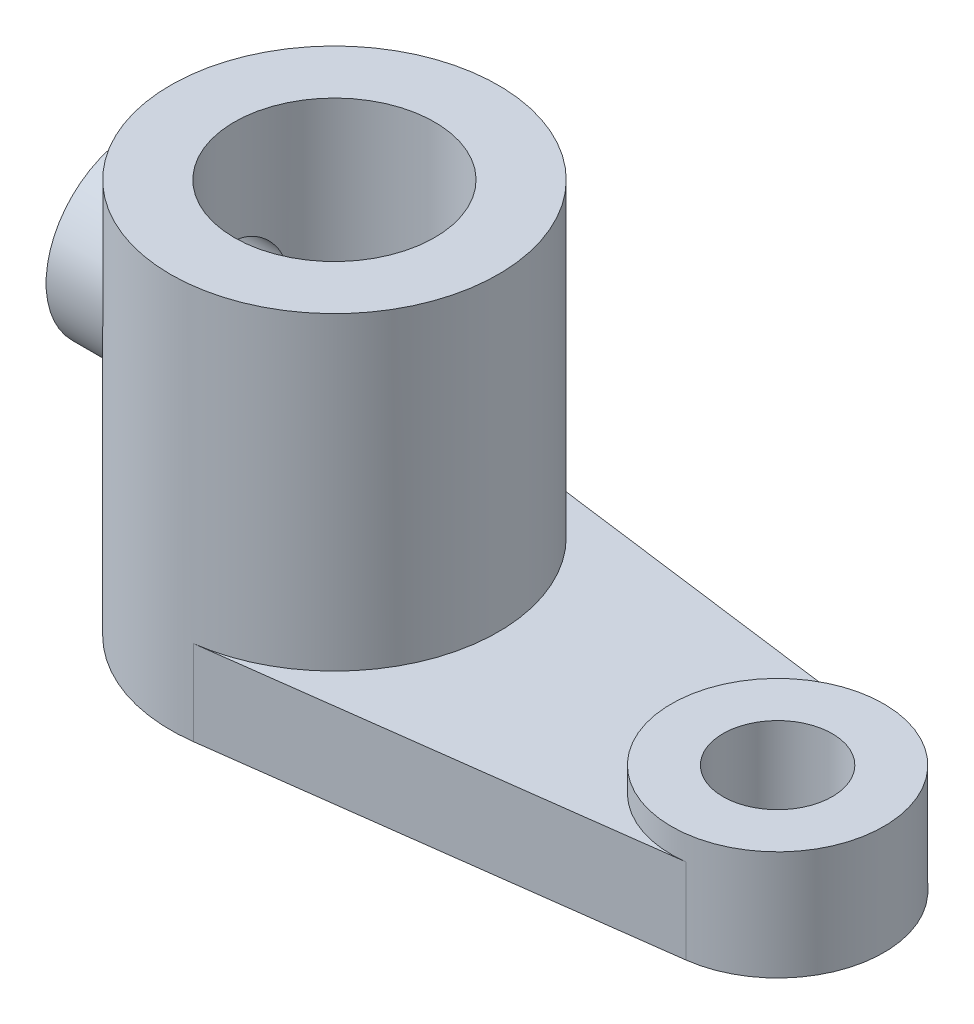
ISO-10303-21;
HEADER;
FILE_DESCRIPTION(('STEP AP214'),'2;1');
FILE_NAME('part.step','',(''),(''),'','','');
FILE_SCHEMA(('AUTOMOTIVE_DESIGN { 1 0 10303 214 1 1 1 1 }'));
ENDSEC;
DATA;
#1=APPLICATION_CONTEXT('core data for automotive mechanical design processes');
#2=APPLICATION_PROTOCOL_DEFINITION('international standard','automotive_design',2000,#1);
#3=PRODUCT_CONTEXT('',#1,'mechanical');
#4=PRODUCT('Part','Part','',(#3));
#5=PRODUCT_RELATED_PRODUCT_CATEGORY('part','',(#4));
#6=PRODUCT_DEFINITION_FORMATION('','',#4);
#7=PRODUCT_DEFINITION_CONTEXT('part definition',#1,'design');
#8=PRODUCT_DEFINITION('design','',#6,#7);
#9=PRODUCT_DEFINITION_SHAPE('','',#8);
#10=(LENGTH_UNIT() NAMED_UNIT(*) SI_UNIT(.MILLI.,.METRE.));
#11=(NAMED_UNIT(*) PLANE_ANGLE_UNIT() SI_UNIT($,.RADIAN.));
#12=(NAMED_UNIT(*) SI_UNIT($,.STERADIAN.) SOLID_ANGLE_UNIT());
#13=UNCERTAINTY_MEASURE_WITH_UNIT(LENGTH_MEASURE(1.E-05),#10,'distance_accuracy_value','');
#14=(GEOMETRIC_REPRESENTATION_CONTEXT(3) GLOBAL_UNCERTAINTY_ASSIGNED_CONTEXT((#13)) GLOBAL_UNIT_ASSIGNED_CONTEXT((#10,
#11,#12)) REPRESENTATION_CONTEXT('',''));
#15=CARTESIAN_POINT('',(0.,0.,0.));
#16=DIRECTION('',(0.,0.,1.));
#17=DIRECTION('',(1.,0.,0.));
#18=AXIS2_PLACEMENT_3D('',#15,#16,#17);
#19=CARTESIAN_POINT('',(0.,14.,0.));
#20=DIRECTION('',(0.,1.,0.));
#21=DIRECTION('',(0.,0.,1.));
#22=AXIS2_PLACEMENT_3D('',#19,#20,#21);
#23=PLANE('',#22);
#24=DIRECTION('',(0.991496023590815,0.,-0.13013698630137));
#25=VECTOR('',#24,1.);
#26=CARTESIAN_POINT('',(3.51369863013698,14.,26.770392636952));
#27=LINE('',#26,#25);
#28=CARTESIAN_POINT('',(3.51369863013698,14.,26.770392636952));
#29=VERTEX_POINT('',#28);
#30=CARTESIAN_POINT('',(75.277397260274,14.,17.3511804128393));
#31=VERTEX_POINT('',#30);
#32=EDGE_CURVE('E89',#29,#31,#27,.T.);
#33=ORIENTED_EDGE('',*,*,#32,.T.);
#34=CARTESIAN_POINT('',(73.,14.,0.));
#35=DIRECTION('',(0.,1.,0.));
#36=DIRECTION('',(0.,0.,1.));
#37=AXIS2_PLACEMENT_3D('',#34,#35,#36);
#38=CIRCLE('',#37,17.5);
#39=CARTESIAN_POINT('',(75.277397260274,14.,-17.3511804128393));
#40=VERTEX_POINT('',#39);
#41=EDGE_CURVE('E153',#31,#40,#38,.F.);
#42=ORIENTED_EDGE('',*,*,#41,.T.);
#43=DIRECTION('',(-0.991496023590815,0.,-0.13013698630137));
#44=VECTOR('',#43,1.);
#45=CARTESIAN_POINT('',(3.51369863013698,14.,-26.770392636952));
#46=LINE('',#45,#44);
#47=CARTESIAN_POINT('',(3.51369863013698,14.,-26.770392636952));
#48=VERTEX_POINT('',#47);
#49=EDGE_CURVE('E59',#40,#48,#46,.T.);
#50=ORIENTED_EDGE('',*,*,#49,.T.);
#51=CARTESIAN_POINT('',(0.,14.,0.));
#52=DIRECTION('',(0.,1.,0.));
#53=DIRECTION('',(0.,0.,1.));
#54=AXIS2_PLACEMENT_3D('',#51,#52,#53);
#55=CIRCLE('',#54,27.);
#56=EDGE_CURVE('E96',#48,#29,#55,.F.);
#57=ORIENTED_EDGE('',*,*,#56,.T.);
#58=EDGE_LOOP('',(#33,#42,#50,#57));
#59=FACE_BOUND('',#58,.T.);
#60=ADVANCED_FACE('F34',(#59),#23,.T.);
#61=CARTESIAN_POINT('',(0.,14.,0.));
#62=DIRECTION('',(0.,-1.,0.));
#63=DIRECTION('',(0.,0.,-1.));
#64=AXIS2_PLACEMENT_3D('',#61,#62,#63);
#65=CYLINDRICAL_SURFACE('',#64,27.);
#66=CARTESIAN_POINT('',(-22.7760839478607,41.,-14.5));
#67=CARTESIAN_POINT('',(-22.776081424062,41.3734116000968,-14.5000020022645));
#68=CARTESIAN_POINT('',(-22.7852971465726,41.7468005159795,-14.4855580639865));
#69=CARTESIAN_POINT('',(-22.8217856245356,42.4906084286798,-14.4280027894128));
#70=CARTESIAN_POINT('',(-22.8490649794177,42.8610262899645,-14.3848809758183));
#71=CARTESIAN_POINT('',(-22.9206684961074,43.5963835965386,-14.2705111434538));
#72=CARTESIAN_POINT('',(-22.9650188750485,43.9613137137718,-14.1992198584162));
#73=CARTESIAN_POINT('',(-23.0691023552907,44.6825042729277,-14.0294833097798));
#74=CARTESIAN_POINT('',(-23.1288344653196,45.0387652719112,-13.9310397959716));
#75=CARTESIAN_POINT('',(-23.2612136171747,45.7382823590793,-13.7088487688457));
#76=CARTESIAN_POINT('',(-23.3337779168444,46.0816056176032,-13.5852626499237));
#77=CARTESIAN_POINT('',(-23.4898582138453,46.7559633223453,-13.3135681704773));
#78=CARTESIAN_POINT('',(-23.5733784856471,47.0869929071732,-13.1654502329145));
#79=CARTESIAN_POINT('',(-23.7490063309865,47.7351794801339,-12.8459298779056));
#80=CARTESIAN_POINT('',(-23.8411131110286,48.0523377461695,-12.6745296113553));
#81=CARTESIAN_POINT('',(-24.0315790670262,48.6716106499258,-12.3095722061589));
#82=CARTESIAN_POINT('',(-24.1299378095022,48.9737263280389,-12.1160166029082));
#83=CARTESIAN_POINT('',(-24.3402887956095,49.5901975895064,-11.68813445508));
#84=CARTESIAN_POINT('',(-24.4526828156404,49.902938983339,-11.4516773230034));
#85=CARTESIAN_POINT('',(-24.6793648841272,50.507876076628,-10.9546139548814));
#86=CARTESIAN_POINT('',(-24.7936530339021,50.8000706726039,-10.6940064235611));
#87=CARTESIAN_POINT('',(-25.0214303157805,51.3628291479187,-10.1496369933712));
#88=CARTESIAN_POINT('',(-25.1349188027344,51.6333770591432,-9.86585830799691));
#89=CARTESIAN_POINT('',(-25.3582997425367,52.1511385211474,-9.27663058319327));
#90=CARTESIAN_POINT('',(-25.4681934636138,52.3983603606257,-8.97118930945456));
#91=CARTESIAN_POINT('',(-25.6905423675671,52.8871832712985,-8.31419390315221));
#92=CARTESIAN_POINT('',(-25.8024818779587,53.1267006322973,-7.9609091073236));
#93=CARTESIAN_POINT('',(-26.0161168883998,53.5748616282062,-7.23227429476261));
#94=CARTESIAN_POINT('',(-26.11781168672,53.7835031486801,-6.85692276931594));
#95=CARTESIAN_POINT('',(-26.3079776209243,54.1676699371424,-6.08667084413457));
#96=CARTESIAN_POINT('',(-26.3964560932023,54.3432135920838,-5.69178145317668));
#97=CARTESIAN_POINT('',(-26.5575796849824,54.6591919524584,-4.88508456774111));
#98=CARTESIAN_POINT('',(-26.6302267944947,54.7996310708759,-4.47327920735239));
#99=CARTESIAN_POINT('',(-26.7523012617975,55.0337009954067,-3.66962195332311));
#100=CARTESIAN_POINT('',(-26.8031213542871,55.1301778577621,-3.27880971722316));
#101=CARTESIAN_POINT('',(-26.8879886489034,55.290506394613,-2.48874666574624));
#102=CARTESIAN_POINT('',(-26.9220366704676,55.3543596630135,-2.08949626362911));
#103=CARTESIAN_POINT('',(-26.972348731922,55.4485009204491,-1.28618474867826));
#104=CARTESIAN_POINT('',(-26.9886234501707,55.4788090638411,-0.882126672031941));
#105=CARTESIAN_POINT('',(-27.0029363851521,55.5054717354072,-0.0725809038511045));
#106=CARTESIAN_POINT('',(-27.0009759537257,55.5018287805052,0.332906679480876));
#107=CARTESIAN_POINT('',(-26.9799944822037,55.4627216042814,1.10112689683755));
#108=CARTESIAN_POINT('',(-26.9627008408185,55.4304791722405,1.46407633753751));
#109=CARTESIAN_POINT('',(-26.9138269519923,55.3389533388247,2.18554734092193));
#110=CARTESIAN_POINT('',(-26.8822478708902,55.2796721450345,2.54406926263806));
#111=CARTESIAN_POINT('',(-26.8055470262836,55.134748857269,3.25426490493919));
#112=CARTESIAN_POINT('',(-26.7604247988536,55.0491058602579,3.60593839048893));
#113=CARTESIAN_POINT('',(-26.6576685205517,54.8523760695635,4.30021782608481));
#114=CARTESIAN_POINT('',(-26.6000339919438,54.7412883043568,4.6428234293468));
#115=CARTESIAN_POINT('',(-26.4727813588351,54.4933170850671,5.32092521155661));
#116=CARTESIAN_POINT('',(-26.4030314426071,54.3561481329853,5.65629203043604));
#117=CARTESIAN_POINT('',(-26.2535220479595,54.0581022918301,6.31397841325605));
#118=CARTESIAN_POINT('',(-26.1737626070334,53.8972254915608,6.63629802606268));
#119=CARTESIAN_POINT('',(-26.0058573860367,53.5529757375012,7.26648074000126));
#120=CARTESIAN_POINT('',(-25.9177098993155,53.3695982034549,7.57434088006383));
#121=CARTESIAN_POINT('',(-25.7347839283117,52.9815849015126,8.17430609017096));
#122=CARTESIAN_POINT('',(-25.6400047804549,52.776947005276,8.46640957838702));
#123=CARTESIAN_POINT('',(-25.4354836490456,52.3251291152229,9.06343529339001));
#124=CARTESIAN_POINT('',(-25.3252132462494,52.0757381781663,9.36650539396976));
#125=CARTESIAN_POINT('',(-25.101382498915,51.5539071829196,9.95080398277058));
#126=CARTESIAN_POINT('',(-24.987821954287,51.2814657209712,10.2320311387707));
#127=CARTESIAN_POINT('',(-24.7600056288096,50.7146926416434,10.7716268950745));
#128=CARTESIAN_POINT('',(-24.6457494233555,50.4203460913821,11.0299796340473));
#129=CARTESIAN_POINT('',(-24.4193562384989,49.8110716708649,11.5225236953526));
#130=CARTESIAN_POINT('',(-24.3072203065025,49.4961339543075,11.7567033184883));
#131=CARTESIAN_POINT('',(-24.0791055548099,48.820641015672,12.2175302206113));
#132=CARTESIAN_POINT('',(-23.963556549678,48.4584591434577,12.4420139139755));
#133=CARTESIAN_POINT('',(-23.742289453966,47.7136170276856,12.8592164329059));
#134=CARTESIAN_POINT('',(-23.6365662072396,47.3309676926003,13.0519519600651));
#135=CARTESIAN_POINT('',(-23.4388441876554,46.5473429605817,13.4037796708693));
#136=CARTESIAN_POINT('',(-23.3468370154302,46.1463789772491,13.5628924693321));
#137=CARTESIAN_POINT('',(-23.1803069637717,45.3285947369833,13.8455893043974));
#138=CARTESIAN_POINT('',(-23.1057813611171,44.9117769614738,13.9691788753681));
#139=CARTESIAN_POINT('',(-22.9828658765714,44.0999669561409,14.1704141119669));
#140=CARTESIAN_POINT('',(-22.932847288727,43.705943793763,14.2509716071461));
#141=CARTESIAN_POINT('',(-22.8526549744334,42.9105719343786,14.3792184470379));
#142=CARTESIAN_POINT('',(-22.8224800159398,42.5092236937596,14.4269098323389));
#143=CARTESIAN_POINT('',(-22.7833864383949,41.7032534663126,14.4885694984485));
#144=CARTESIAN_POINT('',(-22.7744495646086,41.2986345911079,14.5025667404611));
#145=CARTESIAN_POINT('',(-22.7782097922792,40.48976594304,14.4966612781247));
#146=CARTESIAN_POINT('',(-22.7909048138441,40.08551613843,14.4767618329193));
#147=CARTESIAN_POINT('',(-22.8341544472569,39.3359282988357,14.4084251574576));
#148=CARTESIAN_POINT('',(-22.8620524373132,38.990038329209,14.364225832527));
#149=CARTESIAN_POINT('',(-22.9325764990719,38.3037913224371,14.2513636363631));
#150=CARTESIAN_POINT('',(-22.9752029843959,37.9634344409593,14.1827000780969));
#151=CARTESIAN_POINT('',(-23.0738180280906,37.2902824165714,14.0216907818446));
#152=CARTESIAN_POINT('',(-23.1298099077554,36.9574891757711,13.9293391569593));
#153=CARTESIAN_POINT('',(-23.2534719988106,36.3012957814538,13.7219023988641));
#154=CARTESIAN_POINT('',(-23.3211429938497,35.9778962599416,13.6068157400973));
#155=CARTESIAN_POINT('',(-23.469472202057,35.3280935273407,13.3494148695843));
#156=CARTESIAN_POINT('',(-23.5505681637575,35.0021746431612,13.2061319582182));
#157=CARTESIAN_POINT('',(-23.7212804886226,34.3634407243907,12.8969775305944));
#158=CARTESIAN_POINT('',(-23.8108997084435,34.0506301341413,12.7310984328855));
#159=CARTESIAN_POINT('',(-23.9964483132646,33.439286309487,12.3778138334421));
#160=CARTESIAN_POINT('',(-24.0923790812025,33.140756229031,12.1904036072152));
#161=CARTESIAN_POINT('',(-24.2883737119873,32.5590216609156,11.7950661435755));
#162=CARTESIAN_POINT('',(-24.3884379243237,32.2758184738665,11.5871371691956));
#163=CARTESIAN_POINT('',(-24.6057713370754,31.6843916785855,11.1190018281516));
#164=CARTESIAN_POINT('',(-24.7233700327032,31.378786181774,10.8556321034216));
#165=CARTESIAN_POINT('',(-24.9581501223341,30.7905949443906,10.304390464915));
#166=CARTESIAN_POINT('',(-25.0753316449479,30.5080013906139,10.0165269359322));
#167=CARTESIAN_POINT('',(-25.3065016773112,29.9669172166659,9.41722903527025));
#168=CARTESIAN_POINT('',(-25.4204870864355,29.7084494715677,9.10577279069599));
#169=CARTESIAN_POINT('',(-25.6422794980404,29.2176230069061,8.46106724283571));
#170=CARTESIAN_POINT('',(-25.7500890741837,28.9852533720881,8.12782714336533));
#171=CARTESIAN_POINT('',(-25.9614236868896,28.5386230715355,7.42594063379022));
#172=CARTESIAN_POINT('',(-26.064553268546,28.3256040716484,7.05638229309018));
#173=CARTESIAN_POINT('',(-26.2582908544512,27.931823851728,6.29726825192125));
#174=CARTESIAN_POINT('',(-26.3488982556818,27.751064185053,5.90771158965122));
#175=CARTESIAN_POINT('',(-26.5148412540545,27.4240415009859,5.11159170941332));
#176=CARTESIAN_POINT('',(-26.5901891960632,27.2777505826712,4.70504256217246));
#177=CARTESIAN_POINT('',(-26.7233501158677,27.0214646999711,3.87787803999319));
#178=CARTESIAN_POINT('',(-26.7811655604953,26.9114646292524,3.45726465315557));
#179=CARTESIAN_POINT('',(-26.8725905196709,26.7384805822204,2.6481645121523));
#180=CARTESIAN_POINT('',(-26.9080373214214,26.6719051893145,2.26065015156087));
#181=CARTESIAN_POINT('',(-26.962223238972,26.5704006603751,1.48034265283288));
#182=CARTESIAN_POINT('',(-26.9809634864203,26.5354693808684,1.08754987406924));
#183=CARTESIAN_POINT('',(-27.0012032005291,26.4977510224232,0.300138785719068));
#184=CARTESIAN_POINT('',(-27.0027095265245,26.4949511547448,-0.0944787350275731));
#185=CARTESIAN_POINT('',(-26.9884553863372,26.5215037093104,-0.882307502794273));
#186=CARTESIAN_POINT('',(-26.9726956671577,26.5508547405686,-1.27551880991478));
#187=CARTESIAN_POINT('',(-26.9263719966674,26.6375241737322,-2.02471615408035));
#188=CARTESIAN_POINT('',(-26.897146444071,26.6923170510502,-2.38108131759671));
#189=CARTESIAN_POINT('',(-26.8252473598502,26.8279428514122,-3.08741061147449));
#190=CARTESIAN_POINT('',(-26.7825747731327,26.9087739447911,-3.4373751897697));
#191=CARTESIAN_POINT('',(-26.6847422733359,27.0956193973818,-4.12873397401593));
#192=CARTESIAN_POINT('',(-26.6295815823244,27.2016353254744,-4.4701276445796));
#193=CARTESIAN_POINT('',(-26.5079722968017,27.4378158449344,-5.1423833564603));
#194=CARTESIAN_POINT('',(-26.4415231637255,27.5679815885029,-5.47324489440054));
#195=CARTESIAN_POINT('',(-26.2960829038887,27.8565576579167,-6.13472896472271));
#196=CARTESIAN_POINT('',(-26.2167192985257,28.015833356603,-6.46489166689278));
#197=CARTESIAN_POINT('',(-26.0490431173407,28.3578145637183,-7.11045654554454));
#198=CARTESIAN_POINT('',(-25.9607304204039,28.5405203892538,-7.42585852217365));
#199=CARTESIAN_POINT('',(-25.7769471570726,28.9281265910473,-8.04064460676648));
#200=CARTESIAN_POINT('',(-25.6814744942013,29.1330334757675,-8.34002397890671));
#201=CARTESIAN_POINT('',(-25.4852980886328,29.563777546268,-8.92153398849981));
#202=CARTESIAN_POINT('',(-25.3845938083878,29.7896168847315,-9.20366284695583));
#203=CARTESIAN_POINT('',(-25.1685348350467,30.2873500607954,-9.78007325458587));
#204=CARTESIAN_POINT('',(-25.0527981700594,30.5615715215934,-10.0722051401601));
#205=CARTESIAN_POINT('',(-24.8201540941569,31.1329768077677,-10.6325921893227));
#206=CARTESIAN_POINT('',(-24.7032465955002,31.4301623654351,-10.9008455483489));
#207=CARTESIAN_POINT('',(-24.4710900225063,32.0464637004333,-11.412482717166));
#208=CARTESIAN_POINT('',(-24.3558429913915,32.3656040995645,-11.6558378179695));
#209=CARTESIAN_POINT('',(-24.1302499439828,33.0241217263878,-12.1159688416681));
#210=CARTESIAN_POINT('',(-24.019903660209,33.3634978472523,-12.332746216299));
#211=CARTESIAN_POINT('',(-23.801278083216,34.0808924001276,-12.7498124140696));
#212=CARTESIAN_POINT('',(-23.6934725019951,34.4600108083013,-12.9484644576002));
#213=CARTESIAN_POINT('',(-23.4908060386233,35.2373008117786,-13.3126067052995));
#214=CARTESIAN_POINT('',(-23.395947366783,35.6354756447832,-13.4780912493297));
#215=CARTESIAN_POINT('',(-23.2233043867205,36.4471337834204,-13.773429184059));
#216=CARTESIAN_POINT('',(-23.1454724508892,36.8605705061076,-13.90338222587));
#217=CARTESIAN_POINT('',(-23.0101357121163,37.700332439757,-14.1262420170673));
#218=CARTESIAN_POINT('',(-22.9526175614739,38.1266489870088,-14.2191730978545));
#219=CARTESIAN_POINT('',(-22.8638400325853,38.9592263534592,-14.3614540572045));
#220=CARTESIAN_POINT('',(-22.8310685126014,39.3648949933956,-14.4133251725131));
#221=CARTESIAN_POINT('',(-22.7871915525508,40.180384785092,-14.4825975265611));
#222=CARTESIAN_POINT('',(-22.776086717559,40.5902060524992,-14.4999978026502));
#223=CARTESIAN_POINT('',(-22.7760839478607,41.,-14.5));
#224=B_SPLINE_CURVE_WITH_KNOTS('',3,(#66,#67,#68,#69,#70,#71,#72,#73,#74,#75,#76,#77,#78,#79,
#80,#81,#82,#83,#84,#85,#86,#87,#88,#89,#90,#91,#92,#93,#94,#95,#96,#97,#98,#99,#100,#101,#102,
#103,#104,#105,#106,#107,#108,#109,#110,#111,#112,#113,#114,#115,#116,#117,#118,#119,#120,#121,
#122,#123,#124,#125,#126,#127,#128,#129,#130,#131,#132,#133,#134,#135,#136,#137,#138,#139,#140,
#141,#142,#143,#144,#145,#146,#147,#148,#149,#150,#151,#152,#153,#154,#155,#156,#157,#158,#159,
#160,#161,#162,#163,#164,#165,#166,#167,#168,#169,#170,#171,#172,#173,#174,#175,#176,#177,#178,
#179,#180,#181,#182,#183,#184,#185,#186,#187,#188,#189,#190,#191,#192,#193,#194,#195,#196,#197,
#198,#199,#200,#201,#202,#203,#204,#205,#206,#207,#208,#209,#210,#211,#212,#213,#214,#215,#216,
#217,#218,#219,#220,#221,#222,#223),.UNSPECIFIED.,.T.,.F.,(4,2,2,2,2,2,2,2,2,2,2,2,2,2,2,2,2,2,
2,2,2,2,2,2,2,2,2,2,2,2,2,2,2,2,2,2,2,2,2,2,2,2,2,2,2,2,2,2,2,2,2,2,2,2,2,2,2,2,2,2,2,2,2,2,2,2,
2,2,2,2,2,2,2,2,2,2,2,2,4),(0.,1.11980750502826,2.24002435028043,3.36196849758863,
4.48384035953562,5.59872593672753,6.7140477872749,7.82926667081086,8.9444083148815,
10.1667234093624,11.3891040990882,12.6123783448298,13.8352162615775,15.1572754268533,
16.4794250873912,17.8008380720955,19.122084858597,20.337620956483,21.5530976607123,
22.7678436932921,23.9824996728482,25.075569407279,26.1685499138073,27.2615678650647,
28.3546275565206,29.4604239995666,30.566216300662,31.672234071758,32.7783626713981,
34.0001239276942,35.2219596418945,36.4446360593487,37.6679014748707,38.9907082179591,
40.3128168411005,41.6341124838377,42.9552021626021,44.169220144525,45.3831627438006,
46.5960615470616,47.8088437375119,48.8570910596008,49.9053678221098,50.9539053525816,
52.0025132655067,53.0968620444134,54.191578906738,55.2865364389934,56.3815867419911,
57.6408782000132,58.8997402946281,60.1597841157899,61.4192989590702,62.7340691157899,
64.0489025645348,65.3626680292179,66.676248560541,67.8590052670281,69.0416818512846,
70.2238876978071,71.4060423990519,72.4900050601313,73.5738915694367,74.6578456168042,
75.7418513935378,76.8658792463715,77.9899223135596,79.1142958014045,80.2387850478238,
81.4885926253336,82.7384945739969,83.989821856231,85.241080757643,86.5634371534964,
87.8860190218574,89.2048526351919,90.5228180552496,91.7516966523279,92.9806095672122),.UNSPECIFIED.);
#225=CARTESIAN_POINT('',(-22.7760839478607,41.,-14.5));
#226=VERTEX_POINT('',#225);
#227=EDGE_CURVE('E109',#226,#226,#224,.T.);
#228=ORIENTED_EDGE('',*,*,#227,.T.);
#229=EDGE_LOOP('',(#228));
#230=FACE_BOUND('',#229,.T.);
#231=CARTESIAN_POINT('',(0.,0.,0.));
#232=DIRECTION('',(0.,1.,0.));
#233=DIRECTION('',(0.,0.,1.));
#234=AXIS2_PLACEMENT_3D('',#231,#232,#233);
#235=CIRCLE('',#234,27.);
#236=CARTESIAN_POINT('',(3.51369863013698,0.,-26.770392636952));
#237=VERTEX_POINT('',#236);
#238=CARTESIAN_POINT('',(3.51369863013698,0.,26.770392636952));
#239=VERTEX_POINT('',#238);
#240=EDGE_CURVE('E95',#237,#239,#235,.T.);
#241=ORIENTED_EDGE('',*,*,#240,.T.);
#242=DIRECTION('',(0.,-1.,0.));
#243=VECTOR('',#242,1.);
#244=CARTESIAN_POINT('',(3.51369863013698,14.,26.770392636952));
#245=LINE('',#244,#243);
#246=EDGE_CURVE('E11',#29,#239,#245,.T.);
#247=ORIENTED_EDGE('',*,*,#246,.F.);
#248=ORIENTED_EDGE('',*,*,#56,.F.);
#249=DIRECTION('',(0.,-1.,0.));
#250=VECTOR('',#249,1.);
#251=CARTESIAN_POINT('',(3.51369863013698,14.,-26.770392636952));
#252=LINE('',#251,#250);
#253=EDGE_CURVE('E84',#48,#237,#252,.T.);
#254=ORIENTED_EDGE('',*,*,#253,.T.);
#255=EDGE_LOOP('',(#241,#247,#248,#254));
#256=FACE_BOUND('',#255,.T.);
#257=CARTESIAN_POINT('',(0.,65.,0.));
#258=DIRECTION('',(0.,1.,0.));
#259=DIRECTION('',(0.,0.,1.));
#260=AXIS2_PLACEMENT_3D('',#257,#258,#259);
#261=CIRCLE('',#260,27.);
#262=CARTESIAN_POINT('',(0.,65.,27.));
#263=VERTEX_POINT('',#262);
#264=EDGE_CURVE('E102',#263,#263,#261,.T.);
#265=ORIENTED_EDGE('',*,*,#264,.F.);
#266=EDGE_LOOP('',(#265));
#267=FACE_BOUND('',#266,.T.);
#268=ADVANCED_FACE('F36',(#230,#256,#267),#65,.T.);
#269=CARTESIAN_POINT('',(3.51369863013698,14.,26.770392636952));
#270=DIRECTION('',(-0.13013698630137,0.,-0.991496023590815));
#271=DIRECTION('',(-0.991496023590815,0.,0.13013698630137));
#272=AXIS2_PLACEMENT_3D('',#269,#270,#271);
#273=PLANE('',#272);
#274=DIRECTION('',(0.991496023590815,0.,-0.13013698630137));
#275=VECTOR('',#274,1.);
#276=CARTESIAN_POINT('',(3.51369863013698,0.,26.770392636952));
#277=LINE('',#276,#275);
#278=CARTESIAN_POINT('',(75.277397260274,0.,17.3511804128393));
#279=VERTEX_POINT('',#278);
#280=EDGE_CURVE('E99',#239,#279,#277,.T.);
#281=ORIENTED_EDGE('',*,*,#280,.T.);
#282=DIRECTION('',(0.,-1.,0.));
#283=VECTOR('',#282,1.);
#284=CARTESIAN_POINT('',(75.277397260274,14.,17.3511804128393));
#285=LINE('',#284,#283);
#286=EDGE_CURVE('E50',#31,#279,#285,.T.);
#287=ORIENTED_EDGE('',*,*,#286,.F.);
#288=ORIENTED_EDGE('',*,*,#32,.F.);
#289=ORIENTED_EDGE('',*,*,#246,.T.);
#290=EDGE_LOOP('',(#281,#287,#288,#289));
#291=FACE_BOUND('',#290,.T.);
#292=ADVANCED_FACE('F141',(#291),#273,.F.);
#293=CARTESIAN_POINT('',(73.,14.,0.));
#294=DIRECTION('',(0.,-1.,0.));
#295=DIRECTION('',(0.,0.,-1.));
#296=AXIS2_PLACEMENT_3D('',#293,#294,#295);
#297=CYLINDRICAL_SURFACE('',#296,17.5);
#298=CARTESIAN_POINT('',(73.,0.,0.));
#299=DIRECTION('',(0.,1.,0.));
#300=DIRECTION('',(0.,0.,1.));
#301=AXIS2_PLACEMENT_3D('',#298,#299,#300);
#302=CIRCLE('',#301,17.5);
#303=CARTESIAN_POINT('',(75.277397260274,0.,-17.3511804128393));
#304=VERTEX_POINT('',#303);
#305=EDGE_CURVE('E76',#279,#304,#302,.T.);
#306=ORIENTED_EDGE('',*,*,#305,.T.);
#307=DIRECTION('',(0.,-1.,0.));
#308=VECTOR('',#307,1.);
#309=CARTESIAN_POINT('',(75.277397260274,14.,-17.3511804128393));
#310=LINE('',#309,#308);
#311=EDGE_CURVE('E86',#40,#304,#310,.T.);
#312=ORIENTED_EDGE('',*,*,#311,.F.);
#313=ORIENTED_EDGE('',*,*,#41,.F.);
#314=ORIENTED_EDGE('',*,*,#286,.T.);
#315=EDGE_LOOP('',(#306,#312,#313,#314));
#316=FACE_BOUND('',#315,.T.);
#317=CARTESIAN_POINT('',(73.,18.,0.));
#318=DIRECTION('',(0.,1.,0.));
#319=DIRECTION('',(0.,0.,1.));
#320=AXIS2_PLACEMENT_3D('',#317,#318,#319);
#321=CIRCLE('',#320,17.5);
#322=CARTESIAN_POINT('',(73.,18.,17.5));
#323=VERTEX_POINT('',#322);
#324=EDGE_CURVE('E115',#323,#323,#321,.T.);
#325=ORIENTED_EDGE('',*,*,#324,.F.);
#326=EDGE_LOOP('',(#325));
#327=FACE_BOUND('',#326,.T.);
#328=ADVANCED_FACE('F139',(#316,#327),#297,.T.);
#329=CARTESIAN_POINT('',(3.51369863013698,14.,-26.770392636952));
#330=DIRECTION('',(-0.13013698630137,0.,0.991496023590815));
#331=DIRECTION('',(0.991496023590815,0.,0.13013698630137));
#332=AXIS2_PLACEMENT_3D('',#329,#330,#331);
#333=PLANE('',#332);
#334=DIRECTION('',(-0.991496023590815,0.,-0.13013698630137));
#335=VECTOR('',#334,1.);
#336=CARTESIAN_POINT('',(3.51369863013698,0.,-26.770392636952));
#337=LINE('',#336,#335);
#338=EDGE_CURVE('E81',#304,#237,#337,.T.);
#339=ORIENTED_EDGE('',*,*,#338,.T.);
#340=ORIENTED_EDGE('',*,*,#253,.F.);
#341=ORIENTED_EDGE('',*,*,#49,.F.);
#342=ORIENTED_EDGE('',*,*,#311,.T.);
#343=EDGE_LOOP('',(#339,#340,#341,#342));
#344=FACE_BOUND('',#343,.T.);
#345=ADVANCED_FACE('F83',(#344),#333,.F.);
#346=CARTESIAN_POINT('',(0.,0.,0.));
#347=DIRECTION('',(0.,1.,0.));
#348=DIRECTION('',(0.,0.,1.));
#349=AXIS2_PLACEMENT_3D('',#346,#347,#348);
#350=PLANE('',#349);
#351=CARTESIAN_POINT('',(73.,0.,0.));
#352=DIRECTION('',(0.,1.,0.));
#353=DIRECTION('',(0.,0.,1.));
#354=AXIS2_PLACEMENT_3D('',#351,#352,#353);
#355=CIRCLE('',#354,9.);
#356=CARTESIAN_POINT('',(73.,0.,9.));
#357=VERTEX_POINT('',#356);
#358=EDGE_CURVE('E168',#357,#357,#355,.T.);
#359=ORIENTED_EDGE('',*,*,#358,.T.);
#360=EDGE_LOOP('',(#359));
#361=FACE_BOUND('',#360,.T.);
#362=CARTESIAN_POINT('',(0.,0.,0.));
#363=DIRECTION('',(0.,1.,0.));
#364=DIRECTION('',(0.,0.,1.));
#365=AXIS2_PLACEMENT_3D('',#362,#363,#364);
#366=CIRCLE('',#365,16.5);
#367=CARTESIAN_POINT('',(0.,0.,16.5));
#368=VERTEX_POINT('',#367);
#369=EDGE_CURVE('E164',#368,#368,#366,.T.);
#370=ORIENTED_EDGE('',*,*,#369,.T.);
#371=EDGE_LOOP('',(#370));
#372=FACE_BOUND('',#371,.T.);
#373=ORIENTED_EDGE('',*,*,#338,.F.);
#374=ORIENTED_EDGE('',*,*,#305,.F.);
#375=ORIENTED_EDGE('',*,*,#280,.F.);
#376=ORIENTED_EDGE('',*,*,#240,.F.);
#377=EDGE_LOOP('',(#373,#374,#375,#376));
#378=FACE_BOUND('',#377,.T.);
#379=ADVANCED_FACE('F98',(#361,#372,#378),#350,.F.);
#380=CARTESIAN_POINT('',(0.,65.,0.));
#381=DIRECTION('',(0.,1.,0.));
#382=DIRECTION('',(0.,0.,1.));
#383=AXIS2_PLACEMENT_3D('',#380,#381,#382);
#384=PLANE('',#383);
#385=CARTESIAN_POINT('',(0.,65.,0.));
#386=DIRECTION('',(0.,1.,0.));
#387=DIRECTION('',(0.,0.,1.));
#388=AXIS2_PLACEMENT_3D('',#385,#386,#387);
#389=CIRCLE('',#388,16.5);
#390=CARTESIAN_POINT('',(0.,65.,16.5));
#391=VERTEX_POINT('',#390);
#392=EDGE_CURVE('E165',#391,#391,#389,.T.);
#393=ORIENTED_EDGE('',*,*,#392,.F.);
#394=EDGE_LOOP('',(#393));
#395=FACE_BOUND('',#394,.T.);
#396=ORIENTED_EDGE('',*,*,#264,.T.);
#397=EDGE_LOOP('',(#396));
#398=FACE_BOUND('',#397,.T.);
#399=ADVANCED_FACE('F127',(#395,#398),#384,.T.);
#400=CARTESIAN_POINT('',(73.,18.,0.));
#401=DIRECTION('',(0.,1.,0.));
#402=DIRECTION('',(0.,0.,1.));
#403=AXIS2_PLACEMENT_3D('',#400,#401,#402);
#404=PLANE('',#403);
#405=CARTESIAN_POINT('',(73.,18.,0.));
#406=DIRECTION('',(0.,1.,0.));
#407=DIRECTION('',(0.,0.,1.));
#408=AXIS2_PLACEMENT_3D('',#405,#406,#407);
#409=CIRCLE('',#408,9.);
#410=CARTESIAN_POINT('',(73.,18.,9.));
#411=VERTEX_POINT('',#410);
#412=EDGE_CURVE('E171',#411,#411,#409,.T.);
#413=ORIENTED_EDGE('',*,*,#412,.F.);
#414=EDGE_LOOP('',(#413));
#415=FACE_BOUND('',#414,.T.);
#416=ORIENTED_EDGE('',*,*,#324,.T.);
#417=EDGE_LOOP('',(#416));
#418=FACE_BOUND('',#417,.T.);
#419=ADVANCED_FACE('F123',(#415,#418),#404,.T.);
#420=CARTESIAN_POINT('',(-33.,41.,0.));
#421=DIRECTION('',(1.,0.,0.));
#422=DIRECTION('',(0.,0.,-1.));
#423=AXIS2_PLACEMENT_3D('',#420,#421,#422);
#424=CYLINDRICAL_SURFACE('',#423,14.5);
#425=CARTESIAN_POINT('',(-33.,41.,0.));
#426=DIRECTION('',(1.,0.,0.));
#427=DIRECTION('',(0.,0.,-1.));
#428=AXIS2_PLACEMENT_3D('',#425,#426,#427);
#429=CIRCLE('',#428,14.5);
#430=CARTESIAN_POINT('',(-33.,41.,-14.5));
#431=VERTEX_POINT('',#430);
#432=EDGE_CURVE('E116',#431,#431,#429,.T.);
#433=ORIENTED_EDGE('',*,*,#432,.T.);
#434=EDGE_LOOP('',(#433));
#435=FACE_BOUND('',#434,.T.);
#436=ORIENTED_EDGE('',*,*,#227,.F.);
#437=EDGE_LOOP('',(#436));
#438=FACE_BOUND('',#437,.T.);
#439=ADVANCED_FACE('F117',(#435,#438),#424,.T.);
#440=CARTESIAN_POINT('',(-33.,41.,0.));
#441=DIRECTION('',(1.,0.,0.));
#442=DIRECTION('',(0.,0.,-1.));
#443=AXIS2_PLACEMENT_3D('',#440,#441,#442);
#444=PLANE('',#443);
#445=CARTESIAN_POINT('',(-33.,41.,0.));
#446=DIRECTION('',(-1.,0.,0.));
#447=DIRECTION('',(0.,0.,1.));
#448=AXIS2_PLACEMENT_3D('',#445,#446,#447);
#449=CIRCLE('',#448,7.);
#450=CARTESIAN_POINT('',(-33.,41.,7.));
#451=VERTEX_POINT('',#450);
#452=EDGE_CURVE('E176',#451,#451,#449,.T.);
#453=ORIENTED_EDGE('',*,*,#452,.F.);
#454=EDGE_LOOP('',(#453));
#455=FACE_BOUND('',#454,.T.);
#456=ORIENTED_EDGE('',*,*,#432,.F.);
#457=EDGE_LOOP('',(#456));
#458=FACE_BOUND('',#457,.T.);
#459=ADVANCED_FACE('F122',(#455,#458),#444,.F.);
#460=CARTESIAN_POINT('',(0.,0.,0.));
#461=DIRECTION('',(0.,1.,0.));
#462=DIRECTION('',(0.,0.,1.));
#463=AXIS2_PLACEMENT_3D('',#460,#461,#462);
#464=CYLINDRICAL_SURFACE('',#463,16.5);
#465=CARTESIAN_POINT('',(-14.9415527974839,41.,7.));
#466=CARTESIAN_POINT('',(-14.9415542491956,41.1864066569837,6.99999863312013));
#467=CARTESIAN_POINT('',(-14.94505319532,41.3728754786222,6.99254337439998));
#468=CARTESIAN_POINT('',(-14.9589334577153,41.7444506945283,6.96279905274031));
#469=CARTESIAN_POINT('',(-14.9693191612165,41.9295561442008,6.94050053382054));
#470=CARTESIAN_POINT('',(-14.9966443867314,42.2973186818786,6.88125871164022));
#471=CARTESIAN_POINT('',(-15.0135975601254,42.4799698446125,6.84428489982499));
#472=CARTESIAN_POINT('',(-15.0534966394652,42.8411976626003,6.75607709535171));
#473=CARTESIAN_POINT('',(-15.0764450742026,43.0197725638495,6.70483708463338));
#474=CARTESIAN_POINT('',(-15.127479207954,43.3707903413795,6.58888166117535));
#475=CARTESIAN_POINT('',(-15.1555405847377,43.5432578182938,6.524229854671));
#476=CARTESIAN_POINT('',(-15.2160447873998,43.8819793214765,6.38184631062671));
#477=CARTESIAN_POINT('',(-15.2484892856426,44.0482309450436,6.3041095777814));
#478=CARTESIAN_POINT('',(-15.3168189697178,44.3734564304399,6.13622527557971));
#479=CARTESIAN_POINT('',(-15.3527018979974,44.5324349675719,6.04608583268767));
#480=CARTESIAN_POINT('',(-15.4269931307447,44.842497307913,5.8539298790037));
#481=CARTESIAN_POINT('',(-15.4654023524846,44.9935782074338,5.75190904371871));
#482=CARTESIAN_POINT('',(-15.5460664385734,45.2956476379631,5.53032689295009));
#483=CARTESIAN_POINT('',(-15.588414885283,45.44611533223,5.41008910709684));
#484=CARTESIAN_POINT('',(-15.6737228261636,45.736545191174,5.15772739926316));
#485=CARTESIAN_POINT('',(-15.7166823401729,45.8765070138476,5.0256030906416));
#486=CARTESIAN_POINT('',(-15.8021253484577,46.1452312645192,4.7501199971616));
#487=CARTESIAN_POINT('',(-15.8446085626509,46.2739873761155,4.60675496160214));
#488=CARTESIAN_POINT('',(-15.9279788558967,46.5194046425617,4.30967306397208));
#489=CARTESIAN_POINT('',(-15.9688664791365,46.6360699439445,4.15595978085621));
#490=CARTESIAN_POINT('',(-16.049838109258,46.8616457450159,3.83169392254673));
#491=CARTESIAN_POINT('',(-16.0897995706217,46.9699564649791,3.66069255966992));
#492=CARTESIAN_POINT('',(-16.1657205604987,47.1716488212813,3.30934482053103));
#493=CARTESIAN_POINT('',(-16.2016817351532,47.2650366054523,3.12900233330733));
#494=CARTESIAN_POINT('',(-16.2685841645999,47.4360723058224,2.76012599219259));
#495=CARTESIAN_POINT('',(-16.2995260815266,47.51372229847,2.57159322292083));
#496=CARTESIAN_POINT('',(-16.3554773117074,47.6524938098621,2.1876875410096));
#497=CARTESIAN_POINT('',(-16.3804870573816,47.7136165333923,1.99231512813185));
#498=CARTESIAN_POINT('',(-16.422648402698,47.8158218462662,1.60690949028786));
#499=CARTESIAN_POINT('',(-16.4401498832007,47.8578043807387,1.41715300118683));
#500=CARTESIAN_POINT('',(-16.468667108262,47.9258901812199,1.03432904504552));
#501=CARTESIAN_POINT('',(-16.479683065374,47.9519939676318,0.841261686727462));
#502=CARTESIAN_POINT('',(-16.4949099914829,47.9880127488414,0.453424665441264));
#503=CARTESIAN_POINT('',(-16.4991233968169,47.9979335395996,0.258655637065744));
#504=CARTESIAN_POINT('',(-16.5006299031199,48.0014849432004,-0.13105413323687));
#505=CARTESIAN_POINT('',(-16.497923284105,47.9951162151921,-0.325994867896851));
#506=CARTESIAN_POINT('',(-16.486059151676,47.9670862902323,-0.702135656575797));
#507=CARTESIAN_POINT('',(-16.4773210153498,47.9464190764265,-0.883424082955972));
#508=CARTESIAN_POINT('',(-16.4540628040273,47.8910676989722,-1.24353612909299));
#509=CARTESIAN_POINT('',(-16.4395407247901,47.8563786764512,-1.42235887219951));
#510=CARTESIAN_POINT('',(-16.4050816919428,47.7733396511255,-1.77619991501723));
#511=CARTESIAN_POINT('',(-16.3851465772797,47.7249942875055,-1.95121948499476));
#512=CARTESIAN_POINT('',(-16.3403351958501,47.6150640812673,-2.2964672647642));
#513=CARTESIAN_POINT('',(-16.3154570484272,47.5534741988223,-2.46669362267092));
#514=CARTESIAN_POINT('',(-16.2609494422647,47.4165782558157,-2.80376618434619));
#515=CARTESIAN_POINT('',(-16.2312548022629,47.3410817646533,-2.97052442163748));
#516=CARTESIAN_POINT('',(-16.1680778729285,47.1775746247827,-3.2971100770967));
#517=CARTESIAN_POINT('',(-16.1345942018734,47.0895594079228,-3.45693493733171));
#518=CARTESIAN_POINT('',(-16.0646225801752,46.9016691101355,-3.76874417463487));
#519=CARTESIAN_POINT('',(-16.0281348043905,46.8017947193397,-3.92072900720718));
#520=CARTESIAN_POINT('',(-15.9529667670928,46.5907843444805,-4.21617103403119));
#521=CARTESIAN_POINT('',(-15.9142857210154,46.4796443191959,-4.35962513864264));
#522=CARTESIAN_POINT('',(-15.8327531200246,46.2383096992324,-4.64735184077521));
#523=CARTESIAN_POINT('',(-15.7898026263939,46.1073176125843,-4.79092827884626));
#524=CARTESIAN_POINT('',(-15.7035024419067,45.8339229600698,-5.06664423556382));
#525=CARTESIAN_POINT('',(-15.6601527378182,45.6915200147731,-5.19878337359659));
#526=CARTESIAN_POINT('',(-15.5741734415646,45.3960061512935,-5.45095221916142));
#527=CARTESIAN_POINT('',(-15.5315442951359,45.2428888860271,-5.57097464424095));
#528=CARTESIAN_POINT('',(-15.4482156997022,44.926904828771,-5.79803897447289));
#529=CARTESIAN_POINT('',(-15.4075155521498,44.7640416151712,-5.90508560075856));
#530=CARTESIAN_POINT('',(-15.3277992361077,44.423420256219,-6.10909102374318));
#531=CARTESIAN_POINT('',(-15.2888949760148,44.2453379874626,-6.20555357025482));
#532=CARTESIAN_POINT('',(-15.2156848673609,43.8807856996274,-6.38295740528189));
#533=CARTESIAN_POINT('',(-15.1813770055646,43.6943194008918,-6.46390549590569));
#534=CARTESIAN_POINT('',(-15.1185540814173,43.3142556348621,-6.60950936478357));
#535=CARTESIAN_POINT('',(-15.0900368504601,43.1206608694041,-6.67417124445473));
#536=CARTESIAN_POINT('',(-15.0398516079723,42.7277386051485,-6.7865056139471));
#537=CARTESIAN_POINT('',(-15.0181829592585,42.5284116415508,-6.83417968434472));
#538=CARTESIAN_POINT('',(-14.9837396023757,42.1390842979487,-6.90935155845795));
#539=CARTESIAN_POINT('',(-14.9704690410255,41.9493458324895,-6.9379807872881));
#540=CARTESIAN_POINT('',(-14.9511237546099,41.5677947097713,-6.9795723229251));
#541=CARTESIAN_POINT('',(-14.9450487060004,41.3759821461648,-6.99253533415946));
#542=CARTESIAN_POINT('',(-14.9403213877217,40.9919113726845,-7.00263005826644));
#543=CARTESIAN_POINT('',(-14.9416667536268,40.7996533242748,-6.99976681398421));
#544=CARTESIAN_POINT('',(-14.951724702928,40.4162211975553,-6.9782569102294));
#545=CARTESIAN_POINT('',(-14.9604370487534,40.2250470844909,-6.95961075972481));
#546=CARTESIAN_POINT('',(-14.9840745239561,39.8582016441916,-6.9085625898307));
#547=CARTESIAN_POINT('',(-14.9985387145408,39.6823575500636,-6.87717818911894));
#548=CARTESIAN_POINT('',(-15.0331412340626,39.3340539174155,-6.80120619910465));
#549=CARTESIAN_POINT('',(-15.0532815102606,39.1615955621773,-6.75661407844044));
#550=CARTESIAN_POINT('',(-15.0986293152663,38.8212255236355,-6.65466004340993));
#551=CARTESIAN_POINT('',(-15.1238358555227,38.6533129605788,-6.59730062002067));
#552=CARTESIAN_POINT('',(-15.1786165577094,38.322881483667,-6.47026907540847));
#553=CARTESIAN_POINT('',(-15.2081924007437,38.1603646754549,-6.40059221297118));
#554=CARTESIAN_POINT('',(-15.2722573381259,37.834815504795,-6.24623330463751));
#555=CARTESIAN_POINT('',(-15.3069023079994,37.6720574716276,-6.16103755944381));
#556=CARTESIAN_POINT('',(-15.3791449511377,37.3541704934357,-5.97842303857807));
#557=CARTESIAN_POINT('',(-15.4167436300066,37.1990441761514,-5.88100009329331));
#558=CARTESIAN_POINT('',(-15.4939246458619,36.8971963853521,-5.6745434568727));
#559=CARTESIAN_POINT('',(-15.5335073969809,36.7504766803484,-5.5655073363483));
#560=CARTESIAN_POINT('',(-15.6136805959882,36.4661686149542,-5.33645029206816));
#561=CARTESIAN_POINT('',(-15.6542710903745,36.3285806769916,-5.21642886075128));
#562=CARTESIAN_POINT('',(-15.7389674291014,36.051879769655,-4.95533107615776));
#563=CARTESIAN_POINT('',(-15.7830778909476,35.9136371847796,-4.81333204157174));
#564=CARTESIAN_POINT('',(-15.8701469029211,35.6495702116704,-4.51797869987444));
#565=CARTESIAN_POINT('',(-15.9131058039269,35.5237420087383,-4.36462790644852));
#566=CARTESIAN_POINT('',(-15.9967559295982,35.2852224782369,-4.04731147483811));
#567=CARTESIAN_POINT('',(-16.0374459883265,35.1725378731517,-3.88334047089318));
#568=CARTESIAN_POINT('',(-16.1154179637393,34.9612639016789,-3.54588154021192));
#569=CARTESIAN_POINT('',(-16.1527013481443,34.8626684547405,-3.37239776396917));
#570=CARTESIAN_POINT('',(-16.2230135352571,34.6799275467363,-3.01611430131225));
#571=CARTESIAN_POINT('',(-16.2560222484435,34.5958497383568,-2.83327588759635));
#572=CARTESIAN_POINT('',(-16.3166302391158,34.4435295175233,-2.46033440575019));
#573=CARTESIAN_POINT('',(-16.3442318197723,34.3752803605599,-2.27023447208145));
#574=CARTESIAN_POINT('',(-16.3932237555011,34.2553143618392,-1.88416109636426));
#575=CARTESIAN_POINT('',(-16.4146159081241,34.2035927351331,-1.68818937228443));
#576=CARTESIAN_POINT('',(-16.4505491334743,34.117259878766,-1.29189901410768));
#577=CARTESIAN_POINT('',(-16.4650907436177,34.0826473069113,-1.09158072228351));
#578=CARTESIAN_POINT('',(-16.4860890484571,34.0328198103868,-0.702844026465137));
#579=CARTESIAN_POINT('',(-16.4930528019019,34.0163868962551,-0.514608210617593));
#580=CARTESIAN_POINT('',(-16.5005074338032,33.9987993035229,-0.137298971086857));
#581=CARTESIAN_POINT('',(-16.500998600519,33.99764394453,0.0517744149196438));
#582=CARTESIAN_POINT('',(-16.4954951576572,34.0106227699619,0.429265778459696));
#583=CARTESIAN_POINT('',(-16.4895016556565,34.0247543433893,0.617683862404897));
#584=CARTESIAN_POINT('',(-16.4711938425335,34.0681450341095,0.992456589743921));
#585=CARTESIAN_POINT('',(-16.458879579307,34.0974040367739,1.17881124876246));
#586=CARTESIAN_POINT('',(-16.4288450031901,34.16933596649,1.54104550374129));
#587=CARTESIAN_POINT('',(-16.4113481678779,34.2114562587874,1.71705390103497));
#588=CARTESIAN_POINT('',(-16.3712323700839,34.3090190193459,2.0647992526969));
#589=CARTESIAN_POINT('',(-16.3486117331362,34.3644658430995,2.23653479028026));
#590=CARTESIAN_POINT('',(-16.2987937074044,34.48817388975,2.57458961145964));
#591=CARTESIAN_POINT('',(-16.2715973600989,34.5564321970291,2.74091011731411));
#592=CARTESIAN_POINT('',(-16.2132405716047,34.7052517663799,3.06729998208887));
#593=CARTESIAN_POINT('',(-16.1820786206958,34.7858177163711,3.22736692976342));
#594=CARTESIAN_POINT('',(-16.115016663475,34.9625547668666,3.54741633201429));
#595=CARTESIAN_POINT('',(-16.0789663023861,35.0592660135829,3.70706900455671));
#596=CARTESIAN_POINT('',(-16.0041591546038,35.2648212131893,4.0177650336908));
#597=CARTESIAN_POINT('',(-15.9654014376636,35.373669344046,4.16880539839637));
#598=CARTESIAN_POINT('',(-15.886099847075,35.602804265625,4.46148230961734));
#599=CARTESIAN_POINT('',(-15.8455556877826,35.7230928892188,4.60311734311945));
#600=CARTESIAN_POINT('',(-15.7636425790508,35.9744115358755,4.8762594786617));
#601=CARTESIAN_POINT('',(-15.7222735974397,36.1054419785402,5.00776618467513));
#602=CARTESIAN_POINT('',(-15.6367544379763,36.3872595511238,5.26897697919923));
#603=CARTESIAN_POINT('',(-15.5926160748394,36.5387891477715,5.39788527511269));
#604=CARTESIAN_POINT('',(-15.5057819770025,36.8524733492968,5.64247878632514));
#605=CARTESIAN_POINT('',(-15.4630857773451,37.0146244792367,5.75816829262164));
#606=CARTESIAN_POINT('',(-15.3803313987134,37.348859095748,5.97569794687206));
#607=CARTESIAN_POINT('',(-15.3402759662117,37.5209525843252,6.0775237898658));
#608=CARTESIAN_POINT('',(-15.2641167299737,37.8738333908877,6.26634706566997));
#609=CARTESIAN_POINT('',(-15.2280111345156,38.0546167129795,6.3533512319411));
#610=CARTESIAN_POINT('',(-15.1610186323885,38.4233247536024,6.51159609954058));
#611=CARTESIAN_POINT('',(-15.1301183526091,38.6112296043269,6.58287734561992));
#612=CARTESIAN_POINT('',(-15.0745302795486,38.9932273117101,6.70919551813913));
#613=CARTESIAN_POINT('',(-15.0498394233941,39.1873170641475,6.76424045566067));
#614=CARTESIAN_POINT('',(-15.0076377208202,39.5797380655541,6.85736252341226));
#615=CARTESIAN_POINT('',(-14.9901079571079,39.7780566639515,6.89548438237531));
#616=CARTESIAN_POINT('',(-14.9628393123852,40.1776708027143,6.95445965631091));
#617=CARTESIAN_POINT('',(-14.953094429011,40.3789639274259,6.97532637592306));
#618=CARTESIAN_POINT('',(-14.9454745065914,40.650582857486,6.99162369988152));
#619=CARTESIAN_POINT('',(-14.9440049457173,40.7204177813417,6.99476382862599));
#620=CARTESIAN_POINT('',(-14.9420438123675,40.8601655538858,6.9989522490033));
#621=CARTESIAN_POINT('',(-14.9415522529433,40.9300784036017,7.00000051272));
#622=CARTESIAN_POINT('',(-14.9415527974839,41.,7.));
#623=B_SPLINE_CURVE_WITH_KNOTS('',3,(#465,#466,#467,#468,#469,#470,#471,#472,#473,#474,#475,
#476,#477,#478,#479,#480,#481,#482,#483,#484,#485,#486,#487,#488,#489,#490,#491,#492,#493,#494,
#495,#496,#497,#498,#499,#500,#501,#502,#503,#504,#505,#506,#507,#508,#509,#510,#511,#512,#513,
#514,#515,#516,#517,#518,#519,#520,#521,#522,#523,#524,#525,#526,#527,#528,#529,#530,#531,#532,
#533,#534,#535,#536,#537,#538,#539,#540,#541,#542,#543,#544,#545,#546,#547,#548,#549,#550,#551,
#552,#553,#554,#555,#556,#557,#558,#559,#560,#561,#562,#563,#564,#565,#566,#567,#568,#569,#570,
#571,#572,#573,#574,#575,#576,#577,#578,#579,#580,#581,#582,#583,#584,#585,#586,#587,#588,#589,
#590,#591,#592,#593,#594,#595,#596,#597,#598,#599,#600,#601,#602,#603,#604,#605,#606,#607,#608,
#609,#610,#611,#612,#613,#614,#615,#616,#617,#618,#619,#620,#621,#622),.UNSPECIFIED.,.T.,.F.,(4,
2,2,2,2,2,2,2,2,2,2,2,2,2,2,2,2,2,2,2,2,2,2,2,2,2,2,2,2,2,2,2,2,2,2,2,2,2,2,2,2,2,2,2,2,2,2,2,2,
2,2,2,2,2,2,2,2,2,2,2,2,2,2,2,2,2,2,2,2,2,2,2,2,2,2,2,2,2,4),(0.,0.559147212591193,
1.11865097431496,1.67932403575041,2.24023397107021,2.79854220127175,3.35706405681294,
3.91522168679369,4.47358310915042,5.06455825055622,5.65555262197376,6.24687799440525,
6.83799989652256,7.45619159171116,8.07412794894574,8.69198272233575,9.30979244391577,
9.8944235410672,10.4790354767413,11.0634379869012,11.6478168498173,12.1951881572488,
12.7427493039923,13.290124662413,13.8377086787634,14.3934393977752,14.9493734287267,
15.5052751235502,16.0613769425479,16.6578370188747,17.2543169367446,17.8511532461777,
18.4477717458421,19.0656789193776,19.6833145568064,20.3007184597434,20.9180649033002,
21.494334154893,22.070577493721,22.6466372301566,23.2226783904947,23.7596902304127,
24.2968865245073,24.8339781001234,25.3712768643491,25.9315194186086,26.4919535436358,
27.0525051383793,27.6130826457236,28.2214612552845,28.8296523358544,29.4381531330841,
30.0463905173024,30.6573899944907,31.2681286475773,31.8786903228382,32.4892040923462,
33.0557273852884,33.6222254477942,34.1886267681054,34.7550237965618,35.2998739928414,
35.8449025045131,36.3898071294998,36.9349198258213,37.5046318752286,38.0745406497073,
38.6445408830669,39.2145633926452,39.8251931817702,40.4356241856807,41.046680353622,
41.6574581752479,42.2666420746733,42.8755248947685,43.4827886765823,44.0895837876382,
44.2993184860828,44.5090559834378),.UNSPECIFIED.);
#624=CARTESIAN_POINT('',(-14.9415527974839,41.,7.));
#625=VERTEX_POINT('',#624);
#626=EDGE_CURVE('E39',#625,#625,#623,.T.);
#627=ORIENTED_EDGE('',*,*,#626,.T.);
#628=EDGE_LOOP('',(#627));
#629=FACE_BOUND('',#628,.T.);
#630=ORIENTED_EDGE('',*,*,#369,.F.);
#631=EDGE_LOOP('',(#630));
#632=FACE_BOUND('',#631,.T.);
#633=ORIENTED_EDGE('',*,*,#392,.T.);
#634=EDGE_LOOP('',(#633));
#635=FACE_BOUND('',#634,.T.);
#636=ADVANCED_FACE('F183',(#629,#632,#635),#464,.F.);
#637=CARTESIAN_POINT('',(73.,0.,0.));
#638=DIRECTION('',(0.,1.,0.));
#639=DIRECTION('',(0.,0.,1.));
#640=AXIS2_PLACEMENT_3D('',#637,#638,#639);
#641=CYLINDRICAL_SURFACE('',#640,9.);
#642=ORIENTED_EDGE('',*,*,#358,.F.);
#643=EDGE_LOOP('',(#642));
#644=FACE_BOUND('',#643,.T.);
#645=ORIENTED_EDGE('',*,*,#412,.T.);
#646=EDGE_LOOP('',(#645));
#647=FACE_BOUND('',#646,.T.);
#648=ADVANCED_FACE('F188',(#644,#647),#641,.F.);
#649=CARTESIAN_POINT('',(0.,41.,0.));
#650=DIRECTION('',(-1.,0.,0.));
#651=DIRECTION('',(0.,0.,1.));
#652=AXIS2_PLACEMENT_3D('',#649,#650,#651);
#653=CYLINDRICAL_SURFACE('',#652,7.);
#654=ORIENTED_EDGE('',*,*,#452,.T.);
#655=EDGE_LOOP('',(#654));
#656=FACE_BOUND('',#655,.T.);
#657=ORIENTED_EDGE('',*,*,#626,.F.);
#658=EDGE_LOOP('',(#657));
#659=FACE_BOUND('',#658,.T.);
#660=ADVANCED_FACE('F186',(#656,#659),#653,.F.);
#661=CLOSED_SHELL('',(#60,#268,#292,#328,#345,#379,#399,#419,#439,#459,#636,#648,#660));
#662=MANIFOLD_SOLID_BREP('B2',#661);
#663=ADVANCED_BREP_SHAPE_REPRESENTATION('',(#18,#662),#14);
#664=SHAPE_DEFINITION_REPRESENTATION(#9,#663);
ENDSEC;
END-ISO-10303-21;
